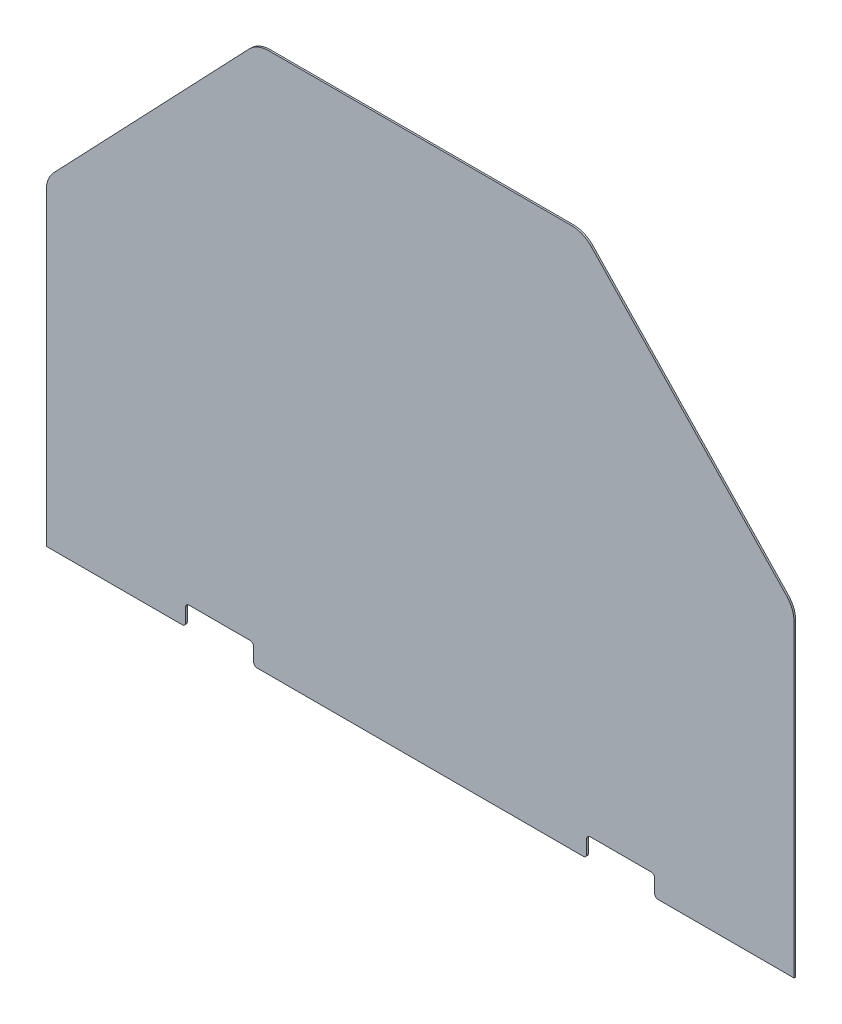
ISO-10303-21;
HEADER;
FILE_DESCRIPTION(('STEP AP214'),'2;1');
FILE_NAME('part.step','',(''),(''),'','','');
FILE_SCHEMA(('AUTOMOTIVE_DESIGN { 1 0 10303 214 1 1 1 1 }'));
ENDSEC;
DATA;
#1=APPLICATION_CONTEXT('core data for automotive mechanical design processes');
#2=APPLICATION_PROTOCOL_DEFINITION('international standard','automotive_design',2000,#1);
#3=PRODUCT_CONTEXT('',#1,'mechanical');
#4=PRODUCT('Part','Part','',(#3));
#5=PRODUCT_RELATED_PRODUCT_CATEGORY('part','',(#4));
#6=PRODUCT_DEFINITION_FORMATION('','',#4);
#7=PRODUCT_DEFINITION_CONTEXT('part definition',#1,'design');
#8=PRODUCT_DEFINITION('design','',#6,#7);
#9=PRODUCT_DEFINITION_SHAPE('','',#8);
#10=(LENGTH_UNIT() NAMED_UNIT(*) SI_UNIT(.MILLI.,.METRE.));
#11=(NAMED_UNIT(*) PLANE_ANGLE_UNIT() SI_UNIT($,.RADIAN.));
#12=(NAMED_UNIT(*) SI_UNIT($,.STERADIAN.) SOLID_ANGLE_UNIT());
#13=UNCERTAINTY_MEASURE_WITH_UNIT(LENGTH_MEASURE(1.E-05),#10,'distance_accuracy_value','');
#14=(GEOMETRIC_REPRESENTATION_CONTEXT(3) GLOBAL_UNCERTAINTY_ASSIGNED_CONTEXT((#13)) GLOBAL_UNIT_ASSIGNED_CONTEXT((#10,
#11,#12)) REPRESENTATION_CONTEXT('',''));
#15=CARTESIAN_POINT('',(0.,0.,0.));
#16=DIRECTION('',(0.,0.,1.));
#17=DIRECTION('',(1.,0.,0.));
#18=AXIS2_PLACEMENT_3D('',#15,#16,#17);
#19=CARTESIAN_POINT('',(-698.5,0.,3.175));
#20=DIRECTION('',(0.,1.,0.));
#21=DIRECTION('',(0.,0.,1.));
#22=AXIS2_PLACEMENT_3D('',#19,#20,#21);
#23=PLANE('',#22);
#24=DIRECTION('',(1.,0.,0.));
#25=VECTOR('',#24,1.);
#26=CARTESIAN_POINT('',(-698.5,0.,3.175));
#27=LINE('',#26,#25);
#28=CARTESIAN_POINT('',(-304.8,0.,3.175));
#29=VERTEX_POINT('',#28);
#30=CARTESIAN_POINT('',(304.8,0.,3.175));
#31=VERTEX_POINT('',#30);
#32=EDGE_CURVE('E241',#29,#31,#27,.T.);
#33=ORIENTED_EDGE('',*,*,#32,.F.);
#34=DIRECTION('',(0.,0.,-1.));
#35=VECTOR('',#34,1.);
#36=CARTESIAN_POINT('',(-304.8,0.,3.175));
#37=LINE('',#36,#35);
#38=CARTESIAN_POINT('',(-304.8,0.,0.));
#39=VERTEX_POINT('',#38);
#40=EDGE_CURVE('E305',#29,#39,#37,.T.);
#41=ORIENTED_EDGE('',*,*,#40,.T.);
#42=DIRECTION('',(1.,0.,0.));
#43=VECTOR('',#42,1.);
#44=CARTESIAN_POINT('',(-698.5,0.,0.));
#45=LINE('',#44,#43);
#46=CARTESIAN_POINT('',(304.8,0.,0.));
#47=VERTEX_POINT('',#46);
#48=EDGE_CURVE('E426',#39,#47,#45,.T.);
#49=ORIENTED_EDGE('',*,*,#48,.T.);
#50=DIRECTION('',(0.,0.,-1.));
#51=VECTOR('',#50,1.);
#52=CARTESIAN_POINT('',(304.8,0.,3.175));
#53=LINE('',#52,#51);
#54=EDGE_CURVE('E303',#47,#31,#53,.F.);
#55=ORIENTED_EDGE('',*,*,#54,.T.);
#56=EDGE_LOOP('',(#33,#41,#49,#55));
#57=FACE_BOUND('',#56,.T.);
#58=ADVANCED_FACE('F38',(#57),#23,.F.);
#59=CARTESIAN_POINT('',(444.5,0.,3.175));
#60=VERTEX_POINT('',#59);
#61=CARTESIAN_POINT('',(698.5,0.,3.175));
#62=VERTEX_POINT('',#61);
#63=EDGE_CURVE('E223',#60,#62,#27,.T.);
#64=ORIENTED_EDGE('',*,*,#63,.F.);
#65=DIRECTION('',(0.,0.,-1.));
#66=VECTOR('',#65,1.);
#67=CARTESIAN_POINT('',(444.5,0.,3.175));
#68=LINE('',#67,#66);
#69=CARTESIAN_POINT('',(444.5,0.,0.));
#70=VERTEX_POINT('',#69);
#71=EDGE_CURVE('E322',#60,#70,#68,.T.);
#72=ORIENTED_EDGE('',*,*,#71,.T.);
#73=CARTESIAN_POINT('',(698.5,0.,0.));
#74=VERTEX_POINT('',#73);
#75=EDGE_CURVE('E255',#70,#74,#45,.T.);
#76=ORIENTED_EDGE('',*,*,#75,.T.);
#77=DIRECTION('',(0.,0.,-1.));
#78=VECTOR('',#77,1.);
#79=CARTESIAN_POINT('',(698.5,0.,3.175));
#80=LINE('',#79,#78);
#81=EDGE_CURVE('E235',#62,#74,#80,.T.);
#82=ORIENTED_EDGE('',*,*,#81,.F.);
#83=EDGE_LOOP('',(#64,#72,#76,#82));
#84=FACE_BOUND('',#83,.T.);
#85=ADVANCED_FACE('F253',(#84),#23,.F.);
#86=CARTESIAN_POINT('',(304.8,1009.65,3.175));
#87=DIRECTION('',(-0.723608232033296,-0.690210929016375,0.));
#88=DIRECTION('',(0.690210929016375,-0.723608232033296,0.));
#89=AXIS2_PLACEMENT_3D('',#86,#87,#88);
#90=PLANE('',#89);
#91=DIRECTION('',(-0.690210929016375,0.723608232033296,0.));
#92=VECTOR('',#91,1.);
#93=CARTESIAN_POINT('',(304.8,1009.65,3.175));
#94=LINE('',#93,#92);
#95=CARTESIAN_POINT('',(684.459298187291,611.620090610097,3.175));
#96=VERTEX_POINT('',#95);
#97=CARTESIAN_POINT('',(319.810948584154,993.912715194032,3.175));
#98=VERTEX_POINT('',#97);
#99=EDGE_CURVE('E370',#96,#98,#94,.T.);
#100=ORIENTED_EDGE('',*,*,#99,.F.);
#101=DIRECTION('',(0.,0.,-1.));
#102=VECTOR('',#101,1.);
#103=CARTESIAN_POINT('',(684.459298187291,611.620090610097,3.175));
#104=LINE('',#103,#102);
#105=CARTESIAN_POINT('',(684.459298187291,611.620090610097,0.));
#106=VERTEX_POINT('',#105);
#107=EDGE_CURVE('E266',#96,#106,#104,.T.);
#108=ORIENTED_EDGE('',*,*,#107,.T.);
#109=DIRECTION('',(-0.690210929016375,0.723608232033296,0.));
#110=VECTOR('',#109,1.);
#111=CARTESIAN_POINT('',(304.8,1009.65,0.));
#112=LINE('',#111,#110);
#113=CARTESIAN_POINT('',(319.810948584154,993.912715194032,0.));
#114=VERTEX_POINT('',#113);
#115=EDGE_CURVE('E400',#106,#114,#112,.T.);
#116=ORIENTED_EDGE('',*,*,#115,.T.);
#117=DIRECTION('',(0.,0.,-1.));
#118=VECTOR('',#117,1.);
#119=CARTESIAN_POINT('',(319.810948584154,993.912715194032,3.175));
#120=LINE('',#119,#118);
#121=EDGE_CURVE('E271',#114,#98,#120,.F.);
#122=ORIENTED_EDGE('',*,*,#121,.T.);
#123=EDGE_LOOP('',(#100,#108,#116,#122));
#124=FACE_BOUND('',#123,.T.);
#125=ADVANCED_FACE('F397',(#124),#90,.F.);
#126=CARTESIAN_POINT('',(-304.8,1009.65,3.175));
#127=DIRECTION('',(0.,-1.,0.));
#128=DIRECTION('',(0.,0.,-1.));
#129=AXIS2_PLACEMENT_3D('',#126,#127,#128);
#130=PLANE('',#129);
#131=DIRECTION('',(-1.,0.,0.));
#132=VECTOR('',#131,1.);
#133=CARTESIAN_POINT('',(-304.8,1009.65,0.));
#134=LINE('',#133,#132);
#135=CARTESIAN_POINT('',(283.051650396863,1009.65,0.));
#136=VERTEX_POINT('',#135);
#137=CARTESIAN_POINT('',(-283.051650396863,1009.65,0.));
#138=VERTEX_POINT('',#137);
#139=EDGE_CURVE('E431',#136,#138,#134,.T.);
#140=ORIENTED_EDGE('',*,*,#139,.T.);
#141=DIRECTION('',(0.,0.,-1.));
#142=VECTOR('',#141,1.);
#143=CARTESIAN_POINT('',(-283.051650396863,1009.65,3.175));
#144=LINE('',#143,#142);
#145=CARTESIAN_POINT('',(-283.051650396863,1009.65,3.175));
#146=VERTEX_POINT('',#145);
#147=EDGE_CURVE('E408',#138,#146,#144,.F.);
#148=ORIENTED_EDGE('',*,*,#147,.T.);
#149=DIRECTION('',(-1.,0.,0.));
#150=VECTOR('',#149,1.);
#151=CARTESIAN_POINT('',(-304.8,1009.65,3.175));
#152=LINE('',#151,#150);
#153=CARTESIAN_POINT('',(283.051650396863,1009.65,3.175));
#154=VERTEX_POINT('',#153);
#155=EDGE_CURVE('E373',#154,#146,#152,.T.);
#156=ORIENTED_EDGE('',*,*,#155,.F.);
#157=DIRECTION('',(0.,0.,-1.));
#158=VECTOR('',#157,1.);
#159=CARTESIAN_POINT('',(283.051650396863,1009.65,3.175));
#160=LINE('',#159,#158);
#161=EDGE_CURVE('E407',#154,#136,#160,.T.);
#162=ORIENTED_EDGE('',*,*,#161,.T.);
#163=EDGE_LOOP('',(#140,#148,#156,#162));
#164=FACE_BOUND('',#163,.T.);
#165=ADVANCED_FACE('F502',(#164),#130,.F.);
#166=CARTESIAN_POINT('',(-304.8,1009.65,3.175));
#167=DIRECTION('',(0.723608232033296,-0.690210929016375,0.));
#168=DIRECTION('',(0.690210929016375,0.723608232033296,0.));
#169=AXIS2_PLACEMENT_3D('',#166,#167,#168);
#170=PLANE('',#169);
#171=DIRECTION('',(-0.690210929016375,-0.723608232033296,0.));
#172=VECTOR('',#171,1.);
#173=CARTESIAN_POINT('',(-304.8,1009.65,3.175));
#174=LINE('',#173,#172);
#175=CARTESIAN_POINT('',(-319.810948584154,993.912715194032,3.175));
#176=VERTEX_POINT('',#175);
#177=CARTESIAN_POINT('',(-684.459298187291,611.620090610097,3.175));
#178=VERTEX_POINT('',#177);
#179=EDGE_CURVE('E224',#176,#178,#174,.T.);
#180=ORIENTED_EDGE('',*,*,#179,.F.);
#181=DIRECTION('',(0.,0.,-1.));
#182=VECTOR('',#181,1.);
#183=CARTESIAN_POINT('',(-319.810948584154,993.912715194032,3.175));
#184=LINE('',#183,#182);
#185=CARTESIAN_POINT('',(-319.810948584154,993.912715194032,0.));
#186=VERTEX_POINT('',#185);
#187=EDGE_CURVE('E420',#176,#186,#184,.T.);
#188=ORIENTED_EDGE('',*,*,#187,.T.);
#189=DIRECTION('',(-0.690210929016375,-0.723608232033296,0.));
#190=VECTOR('',#189,1.);
#191=CARTESIAN_POINT('',(-304.8,1009.65,0.));
#192=LINE('',#191,#190);
#193=CARTESIAN_POINT('',(-684.459298187291,611.620090610097,0.));
#194=VERTEX_POINT('',#193);
#195=EDGE_CURVE('E428',#186,#194,#192,.T.);
#196=ORIENTED_EDGE('',*,*,#195,.T.);
#197=DIRECTION('',(0.,0.,-1.));
#198=VECTOR('',#197,1.);
#199=CARTESIAN_POINT('',(-684.459298187291,611.620090610097,3.175));
#200=LINE('',#199,#198);
#201=EDGE_CURVE('E234',#194,#178,#200,.F.);
#202=ORIENTED_EDGE('',*,*,#201,.T.);
#203=EDGE_LOOP('',(#180,#188,#196,#202));
#204=FACE_BOUND('',#203,.T.);
#205=ADVANCED_FACE('F496',(#204),#170,.F.);
#206=CARTESIAN_POINT('',(-698.5,596.9,3.175));
#207=DIRECTION('',(1.,0.,0.));
#208=DIRECTION('',(0.,1.,0.));
#209=AXIS2_PLACEMENT_3D('',#206,#207,#208);
#210=PLANE('',#209);
#211=DIRECTION('',(0.,-1.,0.));
#212=VECTOR('',#211,1.);
#213=CARTESIAN_POINT('',(-698.5,596.9,3.175));
#214=LINE('',#213,#212);
#215=CARTESIAN_POINT('',(-698.5,576.557375416066,3.175));
#216=VERTEX_POINT('',#215);
#217=CARTESIAN_POINT('',(-698.5,0.,3.175));
#218=VERTEX_POINT('',#217);
#219=EDGE_CURVE('E211',#216,#218,#214,.T.);
#220=ORIENTED_EDGE('',*,*,#219,.F.);
#221=DIRECTION('',(0.,0.,-1.));
#222=VECTOR('',#221,1.);
#223=CARTESIAN_POINT('',(-698.5,576.557375416066,3.175));
#224=LINE('',#223,#222);
#225=CARTESIAN_POINT('',(-698.5,576.557375416066,0.));
#226=VERTEX_POINT('',#225);
#227=EDGE_CURVE('E385',#216,#226,#224,.T.);
#228=ORIENTED_EDGE('',*,*,#227,.T.);
#229=DIRECTION('',(0.,-1.,0.));
#230=VECTOR('',#229,1.);
#231=CARTESIAN_POINT('',(-698.5,596.9,0.));
#232=LINE('',#231,#230);
#233=CARTESIAN_POINT('',(-698.5,0.,0.));
#234=VERTEX_POINT('',#233);
#235=EDGE_CURVE('E230',#226,#234,#232,.T.);
#236=ORIENTED_EDGE('',*,*,#235,.T.);
#237=DIRECTION('',(0.,0.,-1.));
#238=VECTOR('',#237,1.);
#239=CARTESIAN_POINT('',(-698.5,0.,3.175));
#240=LINE('',#239,#238);
#241=EDGE_CURVE('E227',#218,#234,#240,.T.);
#242=ORIENTED_EDGE('',*,*,#241,.F.);
#243=EDGE_LOOP('',(#220,#228,#236,#242));
#244=FACE_BOUND('',#243,.T.);
#245=ADVANCED_FACE('F228',(#244),#210,.F.);
#246=CARTESIAN_POINT('',(-444.5,0.,0.));
#247=VERTEX_POINT('',#246);
#248=EDGE_CURVE('E424',#234,#247,#45,.T.);
#249=ORIENTED_EDGE('',*,*,#248,.T.);
#250=DIRECTION('',(0.,0.,-1.));
#251=VECTOR('',#250,1.);
#252=CARTESIAN_POINT('',(-444.5,0.,3.175));
#253=LINE('',#252,#251);
#254=CARTESIAN_POINT('',(-444.5,0.,3.175));
#255=VERTEX_POINT('',#254);
#256=EDGE_CURVE('E239',#247,#255,#253,.F.);
#257=ORIENTED_EDGE('',*,*,#256,.T.);
#258=EDGE_CURVE('E215',#218,#255,#27,.T.);
#259=ORIENTED_EDGE('',*,*,#258,.F.);
#260=ORIENTED_EDGE('',*,*,#241,.T.);
#261=EDGE_LOOP('',(#249,#257,#259,#260));
#262=FACE_BOUND('',#261,.T.);
#263=ADVANCED_FACE('F237',(#262),#23,.F.);
#264=CARTESIAN_POINT('',(698.5,596.9,3.175));
#265=DIRECTION('',(-1.,0.,0.));
#266=DIRECTION('',(0.,-1.,0.));
#267=AXIS2_PLACEMENT_3D('',#264,#265,#266);
#268=PLANE('',#267);
#269=DIRECTION('',(0.,1.,0.));
#270=VECTOR('',#269,1.);
#271=CARTESIAN_POINT('',(698.5,596.9,0.));
#272=LINE('',#271,#270);
#273=CARTESIAN_POINT('',(698.5,576.557375416066,0.));
#274=VERTEX_POINT('',#273);
#275=EDGE_CURVE('E263',#74,#274,#272,.T.);
#276=ORIENTED_EDGE('',*,*,#275,.T.);
#277=DIRECTION('',(0.,0.,-1.));
#278=VECTOR('',#277,1.);
#279=CARTESIAN_POINT('',(698.5,576.557375416066,3.175));
#280=LINE('',#279,#278);
#281=CARTESIAN_POINT('',(698.5,576.557375416066,3.175));
#282=VERTEX_POINT('',#281);
#283=EDGE_CURVE('E262',#274,#282,#280,.F.);
#284=ORIENTED_EDGE('',*,*,#283,.T.);
#285=DIRECTION('',(0.,1.,0.));
#286=VECTOR('',#285,1.);
#287=CARTESIAN_POINT('',(698.5,596.9,3.175));
#288=LINE('',#287,#286);
#289=EDGE_CURVE('E240',#62,#282,#288,.T.);
#290=ORIENTED_EDGE('',*,*,#289,.F.);
#291=ORIENTED_EDGE('',*,*,#81,.T.);
#292=EDGE_LOOP('',(#276,#284,#290,#291));
#293=FACE_BOUND('',#292,.T.);
#294=ADVANCED_FACE('F260',(#293),#268,.F.);
#295=CARTESIAN_POINT('',(0.,0.,3.175));
#296=DIRECTION('',(0.,0.,-1.));
#297=DIRECTION('',(-1.,0.,0.));
#298=AXIS2_PLACEMENT_3D('',#295,#296,#297);
#299=PLANE('',#298);
#300=ORIENTED_EDGE('',*,*,#258,.T.);
#301=CARTESIAN_POINT('',(-444.5,6.35,3.175));
#302=DIRECTION('',(0.,0.,-1.));
#303=DIRECTION('',(-1.,0.,0.));
#304=AXIS2_PLACEMENT_3D('',#301,#302,#303);
#305=CIRCLE('',#304,6.35);
#306=CARTESIAN_POINT('',(-438.15,6.35000000000001,3.175));
#307=VERTEX_POINT('',#306);
#308=EDGE_CURVE('E296',#255,#307,#305,.F.);
#309=ORIENTED_EDGE('',*,*,#308,.T.);
#310=DIRECTION('',(0.,1.,0.));
#311=VECTOR('',#310,1.);
#312=CARTESIAN_POINT('',(-438.15,1.03389519168218E-12,3.175));
#313=LINE('',#312,#311);
#314=CARTESIAN_POINT('',(-438.15,31.750000000001,3.175));
#315=VERTEX_POINT('',#314);
#316=EDGE_CURVE('E436',#307,#315,#313,.T.);
#317=ORIENTED_EDGE('',*,*,#316,.T.);
#318=CARTESIAN_POINT('',(-431.8,31.750000000001,3.175));
#319=DIRECTION('',(0.,0.,-1.));
#320=DIRECTION('',(-1.,0.,0.));
#321=AXIS2_PLACEMENT_3D('',#318,#319,#320);
#322=CIRCLE('',#321,6.35);
#323=CARTESIAN_POINT('',(-431.8,38.100000000001,3.175));
#324=VERTEX_POINT('',#323);
#325=EDGE_CURVE('E326',#315,#324,#322,.T.);
#326=ORIENTED_EDGE('',*,*,#325,.T.);
#327=DIRECTION('',(1.,0.,0.));
#328=VECTOR('',#327,1.);
#329=CARTESIAN_POINT('',(-311.15,38.100000000001,3.175));
#330=LINE('',#329,#328);
#331=CARTESIAN_POINT('',(-317.5,38.100000000001,3.175));
#332=VERTEX_POINT('',#331);
#333=EDGE_CURVE('E434',#324,#332,#330,.T.);
#334=ORIENTED_EDGE('',*,*,#333,.T.);
#335=CARTESIAN_POINT('',(-317.5,31.750000000001,3.175));
#336=DIRECTION('',(0.,0.,-1.));
#337=DIRECTION('',(-1.,0.,0.));
#338=AXIS2_PLACEMENT_3D('',#335,#336,#337);
#339=CIRCLE('',#338,6.35);
#340=CARTESIAN_POINT('',(-311.15,31.750000000001,3.175));
#341=VERTEX_POINT('',#340);
#342=EDGE_CURVE('E330',#332,#341,#339,.T.);
#343=ORIENTED_EDGE('',*,*,#342,.T.);
#344=DIRECTION('',(0.,-1.,0.));
#345=VECTOR('',#344,1.);
#346=CARTESIAN_POINT('',(-311.15,1.03389519168218E-12,3.175));
#347=LINE('',#346,#345);
#348=CARTESIAN_POINT('',(-311.15,6.35,3.175));
#349=VERTEX_POINT('',#348);
#350=EDGE_CURVE('E441',#341,#349,#347,.T.);
#351=ORIENTED_EDGE('',*,*,#350,.T.);
#352=CARTESIAN_POINT('',(-304.8,6.35,3.175));
#353=DIRECTION('',(0.,0.,-1.));
#354=DIRECTION('',(-1.,0.,0.));
#355=AXIS2_PLACEMENT_3D('',#352,#353,#354);
#356=CIRCLE('',#355,6.35);
#357=EDGE_CURVE('E294',#349,#29,#356,.F.);
#358=ORIENTED_EDGE('',*,*,#357,.T.);
#359=ORIENTED_EDGE('',*,*,#32,.T.);
#360=CARTESIAN_POINT('',(304.8,6.35,3.175));
#361=DIRECTION('',(0.,0.,-1.));
#362=DIRECTION('',(-1.,0.,0.));
#363=AXIS2_PLACEMENT_3D('',#360,#361,#362);
#364=CIRCLE('',#363,6.35);
#365=CARTESIAN_POINT('',(311.15,6.35,3.175));
#366=VERTEX_POINT('',#365);
#367=EDGE_CURVE('E292',#31,#366,#364,.F.);
#368=ORIENTED_EDGE('',*,*,#367,.T.);
#369=DIRECTION('',(0.,1.,0.));
#370=VECTOR('',#369,1.);
#371=CARTESIAN_POINT('',(311.15,1.03389519168218E-12,3.175));
#372=LINE('',#371,#370);
#373=CARTESIAN_POINT('',(311.15,31.750000000001,3.175));
#374=VERTEX_POINT('',#373);
#375=EDGE_CURVE('E363',#366,#374,#372,.T.);
#376=ORIENTED_EDGE('',*,*,#375,.T.);
#377=CARTESIAN_POINT('',(317.5,31.750000000001,3.175));
#378=DIRECTION('',(0.,0.,-1.));
#379=DIRECTION('',(-1.,0.,0.));
#380=AXIS2_PLACEMENT_3D('',#377,#378,#379);
#381=CIRCLE('',#380,6.35);
#382=CARTESIAN_POINT('',(317.5,38.100000000001,3.175));
#383=VERTEX_POINT('',#382);
#384=EDGE_CURVE('E334',#374,#383,#381,.T.);
#385=ORIENTED_EDGE('',*,*,#384,.T.);
#386=DIRECTION('',(1.,0.,0.));
#387=VECTOR('',#386,1.);
#388=CARTESIAN_POINT('',(311.15,38.100000000001,3.175));
#389=LINE('',#388,#387);
#390=CARTESIAN_POINT('',(431.8,38.100000000001,3.175));
#391=VERTEX_POINT('',#390);
#392=EDGE_CURVE('E356',#383,#391,#389,.T.);
#393=ORIENTED_EDGE('',*,*,#392,.T.);
#394=CARTESIAN_POINT('',(431.8,31.750000000001,3.175));
#395=DIRECTION('',(0.,0.,-1.));
#396=DIRECTION('',(-1.,0.,0.));
#397=AXIS2_PLACEMENT_3D('',#394,#395,#396);
#398=CIRCLE('',#397,6.35);
#399=CARTESIAN_POINT('',(438.15,31.750000000001,3.175));
#400=VERTEX_POINT('',#399);
#401=EDGE_CURVE('E11',#391,#400,#398,.T.);
#402=ORIENTED_EDGE('',*,*,#401,.T.);
#403=DIRECTION('',(0.,-1.,0.));
#404=VECTOR('',#403,1.);
#405=CARTESIAN_POINT('',(438.15,1.03389519168218E-12,3.175));
#406=LINE('',#405,#404);
#407=CARTESIAN_POINT('',(438.15,6.35000000000001,3.175));
#408=VERTEX_POINT('',#407);
#409=EDGE_CURVE('E355',#400,#408,#406,.T.);
#410=ORIENTED_EDGE('',*,*,#409,.T.);
#411=CARTESIAN_POINT('',(444.5,6.35,3.175));
#412=DIRECTION('',(0.,0.,-1.));
#413=DIRECTION('',(-1.,0.,0.));
#414=AXIS2_PLACEMENT_3D('',#411,#412,#413);
#415=CIRCLE('',#414,6.35);
#416=EDGE_CURVE('E53',#408,#60,#415,.F.);
#417=ORIENTED_EDGE('',*,*,#416,.T.);
#418=ORIENTED_EDGE('',*,*,#63,.T.);
#419=ORIENTED_EDGE('',*,*,#289,.T.);
#420=CARTESIAN_POINT('',(647.7,576.557375416066,3.175));
#421=DIRECTION('',(0.,0.,-1.));
#422=DIRECTION('',(-1.,0.,0.));
#423=AXIS2_PLACEMENT_3D('',#420,#421,#422);
#424=CIRCLE('',#423,50.8);
#425=EDGE_CURVE('E386',#282,#96,#424,.F.);
#426=ORIENTED_EDGE('',*,*,#425,.T.);
#427=ORIENTED_EDGE('',*,*,#99,.T.);
#428=CARTESIAN_POINT('',(283.051650396863,958.85,3.175));
#429=DIRECTION('',(0.,0.,-1.));
#430=DIRECTION('',(-1.,0.,0.));
#431=AXIS2_PLACEMENT_3D('',#428,#429,#430);
#432=CIRCLE('',#431,50.8);
#433=EDGE_CURVE('E389',#98,#154,#432,.F.);
#434=ORIENTED_EDGE('',*,*,#433,.T.);
#435=ORIENTED_EDGE('',*,*,#155,.T.);
#436=CARTESIAN_POINT('',(-283.051650396863,958.85,3.175));
#437=DIRECTION('',(0.,0.,-1.));
#438=DIRECTION('',(-1.,0.,0.));
#439=AXIS2_PLACEMENT_3D('',#436,#437,#438);
#440=CIRCLE('',#439,50.8);
#441=EDGE_CURVE('E378',#146,#176,#440,.F.);
#442=ORIENTED_EDGE('',*,*,#441,.T.);
#443=ORIENTED_EDGE('',*,*,#179,.T.);
#444=CARTESIAN_POINT('',(-647.7,576.557375416066,3.175));
#445=DIRECTION('',(0.,0.,-1.));
#446=DIRECTION('',(-1.,0.,0.));
#447=AXIS2_PLACEMENT_3D('',#444,#445,#446);
#448=CIRCLE('',#447,50.8);
#449=EDGE_CURVE('E219',#178,#216,#448,.F.);
#450=ORIENTED_EDGE('',*,*,#449,.T.);
#451=ORIENTED_EDGE('',*,*,#219,.T.);
#452=EDGE_LOOP('',(#300,#309,#317,#326,#334,#343,#351,#358,#359,#368,#376,#385,#393,#402,#410,
#417,#418,#419,#426,#427,#434,#435,#442,#443,#450,#451));
#453=FACE_BOUND('',#452,.T.);
#454=ADVANCED_FACE('F213',(#453),#299,.F.);
#455=CARTESIAN_POINT('',(0.,0.,0.));
#456=DIRECTION('',(0.,0.,-1.));
#457=DIRECTION('',(-1.,0.,0.));
#458=AXIS2_PLACEMENT_3D('',#455,#456,#457);
#459=PLANE('',#458);
#460=DIRECTION('',(0.,1.,0.));
#461=VECTOR('',#460,1.);
#462=CARTESIAN_POINT('',(-438.15,1.03389519168218E-12,0.));
#463=LINE('',#462,#461);
#464=CARTESIAN_POINT('',(-438.15,6.35000000000001,0.));
#465=VERTEX_POINT('',#464);
#466=CARTESIAN_POINT('',(-438.15,31.750000000001,0.));
#467=VERTEX_POINT('',#466);
#468=EDGE_CURVE('E361',#465,#467,#463,.T.);
#469=ORIENTED_EDGE('',*,*,#468,.F.);
#470=CARTESIAN_POINT('',(-444.5,6.35,0.));
#471=DIRECTION('',(0.,0.,-1.));
#472=DIRECTION('',(-1.,0.,0.));
#473=AXIS2_PLACEMENT_3D('',#470,#471,#472);
#474=CIRCLE('',#473,6.35);
#475=EDGE_CURVE('E288',#465,#247,#474,.T.);
#476=ORIENTED_EDGE('',*,*,#475,.T.);
#477=ORIENTED_EDGE('',*,*,#248,.F.);
#478=ORIENTED_EDGE('',*,*,#235,.F.);
#479=CARTESIAN_POINT('',(-647.7,576.557375416066,0.));
#480=DIRECTION('',(0.,0.,-1.));
#481=DIRECTION('',(-1.,0.,0.));
#482=AXIS2_PLACEMENT_3D('',#479,#480,#481);
#483=CIRCLE('',#482,50.8);
#484=EDGE_CURVE('E414',#226,#194,#483,.T.);
#485=ORIENTED_EDGE('',*,*,#484,.T.);
#486=ORIENTED_EDGE('',*,*,#195,.F.);
#487=CARTESIAN_POINT('',(-283.051650396863,958.85,0.));
#488=DIRECTION('',(0.,0.,-1.));
#489=DIRECTION('',(-1.,0.,0.));
#490=AXIS2_PLACEMENT_3D('',#487,#488,#489);
#491=CIRCLE('',#490,50.8);
#492=EDGE_CURVE('E412',#186,#138,#491,.T.);
#493=ORIENTED_EDGE('',*,*,#492,.T.);
#494=ORIENTED_EDGE('',*,*,#139,.F.);
#495=CARTESIAN_POINT('',(283.051650396863,958.85,0.));
#496=DIRECTION('',(0.,0.,-1.));
#497=DIRECTION('',(-1.,0.,0.));
#498=AXIS2_PLACEMENT_3D('',#495,#496,#497);
#499=CIRCLE('',#498,50.8);
#500=EDGE_CURVE('E418',#136,#114,#499,.T.);
#501=ORIENTED_EDGE('',*,*,#500,.T.);
#502=ORIENTED_EDGE('',*,*,#115,.F.);
#503=CARTESIAN_POINT('',(647.7,576.557375416066,0.));
#504=DIRECTION('',(0.,0.,-1.));
#505=DIRECTION('',(-1.,0.,0.));
#506=AXIS2_PLACEMENT_3D('',#503,#504,#505);
#507=CIRCLE('',#506,50.8);
#508=EDGE_CURVE('E416',#106,#274,#507,.T.);
#509=ORIENTED_EDGE('',*,*,#508,.T.);
#510=ORIENTED_EDGE('',*,*,#275,.F.);
#511=ORIENTED_EDGE('',*,*,#75,.F.);
#512=CARTESIAN_POINT('',(444.5,6.35,0.));
#513=DIRECTION('',(0.,0.,-1.));
#514=DIRECTION('',(-1.,0.,0.));
#515=AXIS2_PLACEMENT_3D('',#512,#513,#514);
#516=CIRCLE('',#515,6.35);
#517=CARTESIAN_POINT('',(438.15,6.35000000000001,0.));
#518=VERTEX_POINT('',#517);
#519=EDGE_CURVE('E282',#70,#518,#516,.T.);
#520=ORIENTED_EDGE('',*,*,#519,.T.);
#521=DIRECTION('',(0.,-1.,0.));
#522=VECTOR('',#521,1.);
#523=CARTESIAN_POINT('',(438.15,1.03389519168218E-12,0.));
#524=LINE('',#523,#522);
#525=CARTESIAN_POINT('',(438.15,31.750000000001,0.));
#526=VERTEX_POINT('',#525);
#527=EDGE_CURVE('E342',#526,#518,#524,.T.);
#528=ORIENTED_EDGE('',*,*,#527,.F.);
#529=CARTESIAN_POINT('',(431.8,31.750000000001,0.));
#530=DIRECTION('',(0.,0.,-1.));
#531=DIRECTION('',(-1.,0.,0.));
#532=AXIS2_PLACEMENT_3D('',#529,#530,#531);
#533=CIRCLE('',#532,6.35);
#534=CARTESIAN_POINT('',(431.8,38.100000000001,0.));
#535=VERTEX_POINT('',#534);
#536=EDGE_CURVE('E46',#526,#535,#533,.F.);
#537=ORIENTED_EDGE('',*,*,#536,.T.);
#538=DIRECTION('',(1.,0.,0.));
#539=VECTOR('',#538,1.);
#540=CARTESIAN_POINT('',(311.15,38.100000000001,0.));
#541=LINE('',#540,#539);
#542=CARTESIAN_POINT('',(317.5,38.100000000001,0.));
#543=VERTEX_POINT('',#542);
#544=EDGE_CURVE('E341',#543,#535,#541,.T.);
#545=ORIENTED_EDGE('',*,*,#544,.F.);
#546=CARTESIAN_POINT('',(317.5,31.750000000001,0.));
#547=DIRECTION('',(0.,0.,-1.));
#548=DIRECTION('',(-1.,0.,0.));
#549=AXIS2_PLACEMENT_3D('',#546,#547,#548);
#550=CIRCLE('',#549,6.35);
#551=CARTESIAN_POINT('',(311.15,31.750000000001,0.));
#552=VERTEX_POINT('',#551);
#553=EDGE_CURVE('E332',#543,#552,#550,.F.);
#554=ORIENTED_EDGE('',*,*,#553,.T.);
#555=DIRECTION('',(0.,1.,0.));
#556=VECTOR('',#555,1.);
#557=CARTESIAN_POINT('',(311.15,1.03389519168218E-12,0.));
#558=LINE('',#557,#556);
#559=CARTESIAN_POINT('',(311.15,6.35,0.));
#560=VERTEX_POINT('',#559);
#561=EDGE_CURVE('E351',#560,#552,#558,.T.);
#562=ORIENTED_EDGE('',*,*,#561,.F.);
#563=CARTESIAN_POINT('',(304.8,6.35,0.));
#564=DIRECTION('',(0.,0.,-1.));
#565=DIRECTION('',(-1.,0.,0.));
#566=AXIS2_PLACEMENT_3D('',#563,#564,#565);
#567=CIRCLE('',#566,6.35);
#568=EDGE_CURVE('E284',#560,#47,#567,.T.);
#569=ORIENTED_EDGE('',*,*,#568,.T.);
#570=ORIENTED_EDGE('',*,*,#48,.F.);
#571=CARTESIAN_POINT('',(-304.8,6.35,0.));
#572=DIRECTION('',(0.,0.,-1.));
#573=DIRECTION('',(-1.,0.,0.));
#574=AXIS2_PLACEMENT_3D('',#571,#572,#573);
#575=CIRCLE('',#574,6.35);
#576=CARTESIAN_POINT('',(-311.15,6.35,0.));
#577=VERTEX_POINT('',#576);
#578=EDGE_CURVE('E286',#39,#577,#575,.T.);
#579=ORIENTED_EDGE('',*,*,#578,.T.);
#580=DIRECTION('',(0.,-1.,0.));
#581=VECTOR('',#580,1.);
#582=CARTESIAN_POINT('',(-311.15,1.03389519168218E-12,0.));
#583=LINE('',#582,#581);
#584=CARTESIAN_POINT('',(-311.15,31.750000000001,0.));
#585=VERTEX_POINT('',#584);
#586=EDGE_CURVE('E358',#585,#577,#583,.T.);
#587=ORIENTED_EDGE('',*,*,#586,.F.);
#588=CARTESIAN_POINT('',(-317.5,31.750000000001,0.));
#589=DIRECTION('',(0.,0.,-1.));
#590=DIRECTION('',(-1.,0.,0.));
#591=AXIS2_PLACEMENT_3D('',#588,#589,#590);
#592=CIRCLE('',#591,6.35);
#593=CARTESIAN_POINT('',(-317.5,38.100000000001,0.));
#594=VERTEX_POINT('',#593);
#595=EDGE_CURVE('E328',#585,#594,#592,.F.);
#596=ORIENTED_EDGE('',*,*,#595,.T.);
#597=DIRECTION('',(1.,0.,0.));
#598=VECTOR('',#597,1.);
#599=CARTESIAN_POINT('',(-311.15,38.100000000001,0.));
#600=LINE('',#599,#598);
#601=CARTESIAN_POINT('',(-431.8,38.100000000001,0.));
#602=VERTEX_POINT('',#601);
#603=EDGE_CURVE('E447',#602,#594,#600,.T.);
#604=ORIENTED_EDGE('',*,*,#603,.F.);
#605=CARTESIAN_POINT('',(-431.8,31.750000000001,0.));
#606=DIRECTION('',(0.,0.,-1.));
#607=DIRECTION('',(-1.,0.,0.));
#608=AXIS2_PLACEMENT_3D('',#605,#606,#607);
#609=CIRCLE('',#608,6.35);
#610=EDGE_CURVE('E324',#602,#467,#609,.F.);
#611=ORIENTED_EDGE('',*,*,#610,.T.);
#612=EDGE_LOOP('',(#469,#476,#477,#478,#485,#486,#493,#494,#501,#502,#509,#510,#511,#520,#528,
#537,#545,#554,#562,#569,#570,#579,#587,#596,#604,#611));
#613=FACE_BOUND('',#612,.T.);
#614=ADVANCED_FACE('F340',(#613),#459,.T.);
#615=CARTESIAN_POINT('',(-283.051650396863,958.85,3.175));
#616=DIRECTION('',(0.,0.,-1.));
#617=DIRECTION('',(-1.,0.,0.));
#618=AXIS2_PLACEMENT_3D('',#615,#616,#617);
#619=CYLINDRICAL_SURFACE('',#618,50.8);
#620=ORIENTED_EDGE('',*,*,#441,.F.);
#621=ORIENTED_EDGE('',*,*,#147,.F.);
#622=ORIENTED_EDGE('',*,*,#492,.F.);
#623=ORIENTED_EDGE('',*,*,#187,.F.);
#624=EDGE_LOOP('',(#620,#621,#622,#623));
#625=FACE_BOUND('',#624,.T.);
#626=ADVANCED_FACE('F498',(#625),#619,.T.);
#627=CARTESIAN_POINT('',(-647.7,576.557375416066,3.175));
#628=DIRECTION('',(0.,0.,-1.));
#629=DIRECTION('',(-1.,0.,0.));
#630=AXIS2_PLACEMENT_3D('',#627,#628,#629);
#631=CYLINDRICAL_SURFACE('',#630,50.8);
#632=ORIENTED_EDGE('',*,*,#449,.F.);
#633=ORIENTED_EDGE('',*,*,#201,.F.);
#634=ORIENTED_EDGE('',*,*,#484,.F.);
#635=ORIENTED_EDGE('',*,*,#227,.F.);
#636=EDGE_LOOP('',(#632,#633,#634,#635));
#637=FACE_BOUND('',#636,.T.);
#638=ADVANCED_FACE('F384',(#637),#631,.T.);
#639=CARTESIAN_POINT('',(647.7,576.557375416066,3.175));
#640=DIRECTION('',(0.,0.,-1.));
#641=DIRECTION('',(-1.,0.,0.));
#642=AXIS2_PLACEMENT_3D('',#639,#640,#641);
#643=CYLINDRICAL_SURFACE('',#642,50.8);
#644=ORIENTED_EDGE('',*,*,#425,.F.);
#645=ORIENTED_EDGE('',*,*,#283,.F.);
#646=ORIENTED_EDGE('',*,*,#508,.F.);
#647=ORIENTED_EDGE('',*,*,#107,.F.);
#648=EDGE_LOOP('',(#644,#645,#646,#647));
#649=FACE_BOUND('',#648,.T.);
#650=ADVANCED_FACE('F689',(#649),#643,.T.);
#651=CARTESIAN_POINT('',(283.051650396863,958.85,3.175));
#652=DIRECTION('',(0.,0.,-1.));
#653=DIRECTION('',(-1.,0.,0.));
#654=AXIS2_PLACEMENT_3D('',#651,#652,#653);
#655=CYLINDRICAL_SURFACE('',#654,50.8);
#656=ORIENTED_EDGE('',*,*,#433,.F.);
#657=ORIENTED_EDGE('',*,*,#121,.F.);
#658=ORIENTED_EDGE('',*,*,#500,.F.);
#659=ORIENTED_EDGE('',*,*,#161,.F.);
#660=EDGE_LOOP('',(#656,#657,#658,#659));
#661=FACE_BOUND('',#660,.T.);
#662=ADVANCED_FACE('F405',(#661),#655,.T.);
#663=CARTESIAN_POINT('',(438.15,1.03389519168218E-12,3.175));
#664=DIRECTION('',(1.,0.,0.));
#665=DIRECTION('',(0.,1.,0.));
#666=AXIS2_PLACEMENT_3D('',#663,#664,#665);
#667=PLANE('',#666);
#668=ORIENTED_EDGE('',*,*,#409,.F.);
#669=DIRECTION('',(0.,0.,-1.));
#670=VECTOR('',#669,1.);
#671=CARTESIAN_POINT('',(438.15,31.750000000001,0.));
#672=LINE('',#671,#670);
#673=EDGE_CURVE('E319',#400,#526,#672,.T.);
#674=ORIENTED_EDGE('',*,*,#673,.T.);
#675=ORIENTED_EDGE('',*,*,#527,.T.);
#676=DIRECTION('',(0.,0.,-1.));
#677=VECTOR('',#676,1.);
#678=CARTESIAN_POINT('',(438.15,6.35000000000001,3.175));
#679=LINE('',#678,#677);
#680=EDGE_CURVE('E61',#518,#408,#679,.F.);
#681=ORIENTED_EDGE('',*,*,#680,.T.);
#682=EDGE_LOOP('',(#668,#674,#675,#681));
#683=FACE_BOUND('',#682,.T.);
#684=ADVANCED_FACE('F357',(#683),#667,.F.);
#685=CARTESIAN_POINT('',(311.15,38.100000000001,3.175));
#686=DIRECTION('',(0.,1.,0.));
#687=DIRECTION('',(0.,0.,1.));
#688=AXIS2_PLACEMENT_3D('',#685,#686,#687);
#689=PLANE('',#688);
#690=ORIENTED_EDGE('',*,*,#392,.F.);
#691=DIRECTION('',(0.,0.,-1.));
#692=VECTOR('',#691,1.);
#693=CARTESIAN_POINT('',(317.5,38.100000000001,0.));
#694=LINE('',#693,#692);
#695=EDGE_CURVE('E315',#383,#543,#694,.T.);
#696=ORIENTED_EDGE('',*,*,#695,.T.);
#697=ORIENTED_EDGE('',*,*,#544,.T.);
#698=DIRECTION('',(0.,0.,-1.));
#699=VECTOR('',#698,1.);
#700=CARTESIAN_POINT('',(431.8,38.100000000001,3.175));
#701=LINE('',#700,#699);
#702=EDGE_CURVE('E313',#535,#391,#701,.F.);
#703=ORIENTED_EDGE('',*,*,#702,.T.);
#704=EDGE_LOOP('',(#690,#696,#697,#703));
#705=FACE_BOUND('',#704,.T.);
#706=ADVANCED_FACE('F348',(#705),#689,.F.);
#707=CARTESIAN_POINT('',(311.15,1.03389519168218E-12,3.175));
#708=DIRECTION('',(-1.,0.,0.));
#709=DIRECTION('',(0.,0.,1.));
#710=AXIS2_PLACEMENT_3D('',#707,#708,#709);
#711=PLANE('',#710);
#712=ORIENTED_EDGE('',*,*,#375,.F.);
#713=DIRECTION('',(0.,0.,-1.));
#714=VECTOR('',#713,1.);
#715=CARTESIAN_POINT('',(311.15,6.35,3.175));
#716=LINE('',#715,#714);
#717=EDGE_CURVE('E310',#366,#560,#716,.T.);
#718=ORIENTED_EDGE('',*,*,#717,.T.);
#719=ORIENTED_EDGE('',*,*,#561,.T.);
#720=DIRECTION('',(0.,0.,-1.));
#721=VECTOR('',#720,1.);
#722=CARTESIAN_POINT('',(311.15,31.750000000001,3.175));
#723=LINE('',#722,#721);
#724=EDGE_CURVE('E308',#552,#374,#723,.F.);
#725=ORIENTED_EDGE('',*,*,#724,.T.);
#726=EDGE_LOOP('',(#712,#718,#719,#725));
#727=FACE_BOUND('',#726,.T.);
#728=ADVANCED_FACE('F459',(#727),#711,.F.);
#729=CARTESIAN_POINT('',(-311.15,1.03389519168218E-12,3.175));
#730=DIRECTION('',(1.,0.,0.));
#731=DIRECTION('',(0.,0.,-1.));
#732=AXIS2_PLACEMENT_3D('',#729,#730,#731);
#733=PLANE('',#732);
#734=ORIENTED_EDGE('',*,*,#350,.F.);
#735=DIRECTION('',(0.,0.,-1.));
#736=VECTOR('',#735,1.);
#737=CARTESIAN_POINT('',(-311.15,31.750000000001,0.));
#738=LINE('',#737,#736);
#739=EDGE_CURVE('E300',#341,#585,#738,.T.);
#740=ORIENTED_EDGE('',*,*,#739,.T.);
#741=ORIENTED_EDGE('',*,*,#586,.T.);
#742=DIRECTION('',(0.,0.,-1.));
#743=VECTOR('',#742,1.);
#744=CARTESIAN_POINT('',(-311.15,6.35,3.175));
#745=LINE('',#744,#743);
#746=EDGE_CURVE('E298',#577,#349,#745,.F.);
#747=ORIENTED_EDGE('',*,*,#746,.T.);
#748=EDGE_LOOP('',(#734,#740,#741,#747));
#749=FACE_BOUND('',#748,.T.);
#750=ADVANCED_FACE('F475',(#749),#733,.F.);
#751=CARTESIAN_POINT('',(-311.15,38.100000000001,3.175));
#752=DIRECTION('',(0.,1.,0.));
#753=DIRECTION('',(0.,0.,1.));
#754=AXIS2_PLACEMENT_3D('',#751,#752,#753);
#755=PLANE('',#754);
#756=ORIENTED_EDGE('',*,*,#333,.F.);
#757=DIRECTION('',(0.,0.,-1.));
#758=VECTOR('',#757,1.);
#759=CARTESIAN_POINT('',(-431.8,38.100000000001,0.));
#760=LINE('',#759,#758);
#761=EDGE_CURVE('E268',#324,#602,#760,.T.);
#762=ORIENTED_EDGE('',*,*,#761,.T.);
#763=ORIENTED_EDGE('',*,*,#603,.T.);
#764=DIRECTION('',(0.,0.,-1.));
#765=VECTOR('',#764,1.);
#766=CARTESIAN_POINT('',(-317.5,38.100000000001,3.175));
#767=LINE('',#766,#765);
#768=EDGE_CURVE('E265',#594,#332,#767,.F.);
#769=ORIENTED_EDGE('',*,*,#768,.T.);
#770=EDGE_LOOP('',(#756,#762,#763,#769));
#771=FACE_BOUND('',#770,.T.);
#772=ADVANCED_FACE('F483',(#771),#755,.F.);
#773=CARTESIAN_POINT('',(-438.15,1.03389519168218E-12,3.175));
#774=DIRECTION('',(-1.,0.,0.));
#775=DIRECTION('',(0.,-1.,0.));
#776=AXIS2_PLACEMENT_3D('',#773,#774,#775);
#777=PLANE('',#776);
#778=ORIENTED_EDGE('',*,*,#468,.T.);
#779=DIRECTION('',(0.,0.,-1.));
#780=VECTOR('',#779,1.);
#781=CARTESIAN_POINT('',(-438.15,31.750000000001,3.175));
#782=LINE('',#781,#780);
#783=EDGE_CURVE('E280',#467,#315,#782,.F.);
#784=ORIENTED_EDGE('',*,*,#783,.T.);
#785=ORIENTED_EDGE('',*,*,#316,.F.);
#786=DIRECTION('',(0.,0.,-1.));
#787=VECTOR('',#786,1.);
#788=CARTESIAN_POINT('',(-438.15,6.35000000000001,3.175));
#789=LINE('',#788,#787);
#790=EDGE_CURVE('E277',#307,#465,#789,.T.);
#791=ORIENTED_EDGE('',*,*,#790,.T.);
#792=EDGE_LOOP('',(#778,#784,#785,#791));
#793=FACE_BOUND('',#792,.T.);
#794=ADVANCED_FACE('F490',(#793),#777,.F.);
#795=CARTESIAN_POINT('',(-431.8,31.750000000001,3.175));
#796=DIRECTION('',(0.,0.,1.));
#797=DIRECTION('',(1.,0.,0.));
#798=AXIS2_PLACEMENT_3D('',#795,#796,#797);
#799=CYLINDRICAL_SURFACE('',#798,6.35);
#800=ORIENTED_EDGE('',*,*,#325,.F.);
#801=ORIENTED_EDGE('',*,*,#783,.F.);
#802=ORIENTED_EDGE('',*,*,#610,.F.);
#803=ORIENTED_EDGE('',*,*,#761,.F.);
#804=EDGE_LOOP('',(#800,#801,#802,#803));
#805=FACE_BOUND('',#804,.T.);
#806=ADVANCED_FACE('F487',(#805),#799,.F.);
#807=CARTESIAN_POINT('',(-444.5,6.35,3.175));
#808=DIRECTION('',(0.,0.,-1.));
#809=DIRECTION('',(-1.,0.,0.));
#810=AXIS2_PLACEMENT_3D('',#807,#808,#809);
#811=CYLINDRICAL_SURFACE('',#810,6.35);
#812=ORIENTED_EDGE('',*,*,#308,.F.);
#813=ORIENTED_EDGE('',*,*,#256,.F.);
#814=ORIENTED_EDGE('',*,*,#475,.F.);
#815=ORIENTED_EDGE('',*,*,#790,.F.);
#816=EDGE_LOOP('',(#812,#813,#814,#815));
#817=FACE_BOUND('',#816,.T.);
#818=ADVANCED_FACE('F494',(#817),#811,.T.);
#819=CARTESIAN_POINT('',(-317.5,31.750000000001,3.175));
#820=DIRECTION('',(0.,0.,1.));
#821=DIRECTION('',(1.,0.,0.));
#822=AXIS2_PLACEMENT_3D('',#819,#820,#821);
#823=CYLINDRICAL_SURFACE('',#822,6.35);
#824=ORIENTED_EDGE('',*,*,#342,.F.);
#825=ORIENTED_EDGE('',*,*,#768,.F.);
#826=ORIENTED_EDGE('',*,*,#595,.F.);
#827=ORIENTED_EDGE('',*,*,#739,.F.);
#828=EDGE_LOOP('',(#824,#825,#826,#827));
#829=FACE_BOUND('',#828,.T.);
#830=ADVANCED_FACE('F479',(#829),#823,.F.);
#831=CARTESIAN_POINT('',(-304.8,6.35,3.175));
#832=DIRECTION('',(0.,0.,-1.));
#833=DIRECTION('',(-1.,0.,0.));
#834=AXIS2_PLACEMENT_3D('',#831,#832,#833);
#835=CYLINDRICAL_SURFACE('',#834,6.35);
#836=ORIENTED_EDGE('',*,*,#357,.F.);
#837=ORIENTED_EDGE('',*,*,#746,.F.);
#838=ORIENTED_EDGE('',*,*,#578,.F.);
#839=ORIENTED_EDGE('',*,*,#40,.F.);
#840=EDGE_LOOP('',(#836,#837,#838,#839));
#841=FACE_BOUND('',#840,.T.);
#842=ADVANCED_FACE('F470',(#841),#835,.T.);
#843=CARTESIAN_POINT('',(304.8,6.35,3.175));
#844=DIRECTION('',(0.,0.,-1.));
#845=DIRECTION('',(-1.,0.,0.));
#846=AXIS2_PLACEMENT_3D('',#843,#844,#845);
#847=CYLINDRICAL_SURFACE('',#846,6.35);
#848=ORIENTED_EDGE('',*,*,#367,.F.);
#849=ORIENTED_EDGE('',*,*,#54,.F.);
#850=ORIENTED_EDGE('',*,*,#568,.F.);
#851=ORIENTED_EDGE('',*,*,#717,.F.);
#852=EDGE_LOOP('',(#848,#849,#850,#851));
#853=FACE_BOUND('',#852,.T.);
#854=ADVANCED_FACE('F461',(#853),#847,.T.);
#855=CARTESIAN_POINT('',(317.5,31.750000000001,3.175));
#856=DIRECTION('',(0.,0.,1.));
#857=DIRECTION('',(1.,0.,0.));
#858=AXIS2_PLACEMENT_3D('',#855,#856,#857);
#859=CYLINDRICAL_SURFACE('',#858,6.35);
#860=ORIENTED_EDGE('',*,*,#384,.F.);
#861=ORIENTED_EDGE('',*,*,#724,.F.);
#862=ORIENTED_EDGE('',*,*,#553,.F.);
#863=ORIENTED_EDGE('',*,*,#695,.F.);
#864=EDGE_LOOP('',(#860,#861,#862,#863));
#865=FACE_BOUND('',#864,.T.);
#866=ADVANCED_FACE('F457',(#865),#859,.F.);
#867=CARTESIAN_POINT('',(431.8,31.750000000001,3.175));
#868=DIRECTION('',(0.,0.,1.));
#869=DIRECTION('',(1.,0.,0.));
#870=AXIS2_PLACEMENT_3D('',#867,#868,#869);
#871=CYLINDRICAL_SURFACE('',#870,6.35);
#872=ORIENTED_EDGE('',*,*,#401,.F.);
#873=ORIENTED_EDGE('',*,*,#702,.F.);
#874=ORIENTED_EDGE('',*,*,#536,.F.);
#875=ORIENTED_EDGE('',*,*,#673,.F.);
#876=EDGE_LOOP('',(#872,#873,#874,#875));
#877=FACE_BOUND('',#876,.T.);
#878=ADVANCED_FACE('F354',(#877),#871,.F.);
#879=CARTESIAN_POINT('',(444.5,6.35,3.175));
#880=DIRECTION('',(0.,0.,-1.));
#881=DIRECTION('',(-1.,0.,0.));
#882=AXIS2_PLACEMENT_3D('',#879,#880,#881);
#883=CYLINDRICAL_SURFACE('',#882,6.35);
#884=ORIENTED_EDGE('',*,*,#416,.F.);
#885=ORIENTED_EDGE('',*,*,#680,.F.);
#886=ORIENTED_EDGE('',*,*,#519,.F.);
#887=ORIENTED_EDGE('',*,*,#71,.F.);
#888=EDGE_LOOP('',(#884,#885,#886,#887));
#889=FACE_BOUND('',#888,.T.);
#890=ADVANCED_FACE('F40',(#889),#883,.T.);
#891=CLOSED_SHELL('',(#58,#85,#125,#165,#205,#245,#263,#294,#454,#614,#626,#638,#650,#662,#684,
#706,#728,#750,#772,#794,#806,#818,#830,#842,#854,#866,#878,#890));
#892=MANIFOLD_SOLID_BREP('B2',#891);
#893=ADVANCED_BREP_SHAPE_REPRESENTATION('',(#18,#892),#14);
#894=SHAPE_DEFINITION_REPRESENTATION(#9,#893);
ENDSEC;
END-ISO-10303-21;
